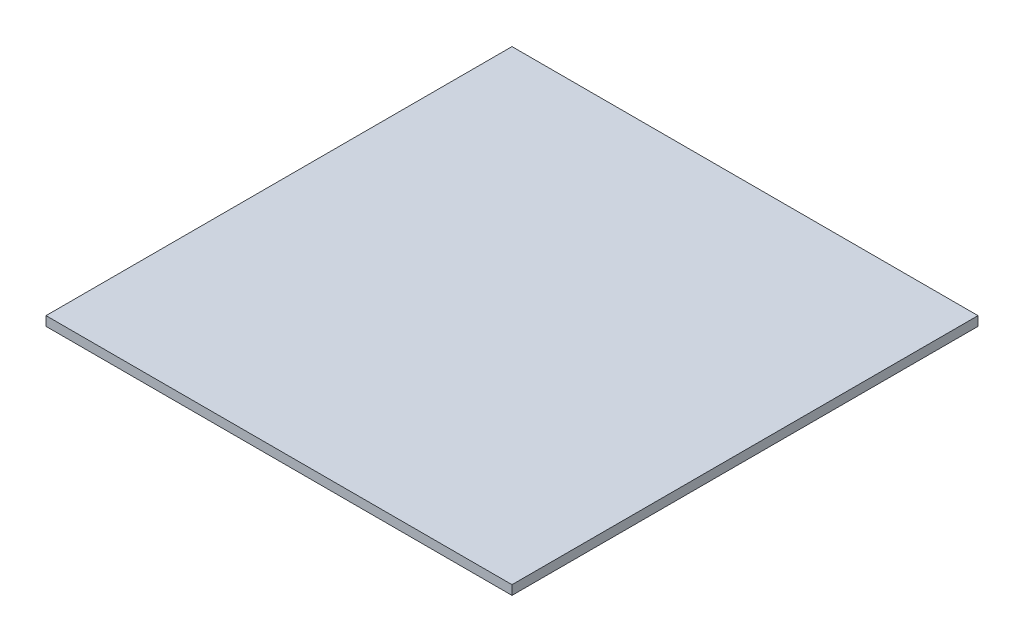
ISO-10303-21;
HEADER;
FILE_DESCRIPTION(('STEP AP214'),'2;1');
FILE_NAME('part.step','',(''),(''),'','','');
FILE_SCHEMA(('AUTOMOTIVE_DESIGN { 1 0 10303 214 1 1 1 1 }'));
ENDSEC;
DATA;
#1=APPLICATION_CONTEXT('core data for automotive mechanical design processes');
#2=APPLICATION_PROTOCOL_DEFINITION('international standard','automotive_design',2000,#1);
#3=PRODUCT_CONTEXT('',#1,'mechanical');
#4=PRODUCT('Part','Part','',(#3));
#5=PRODUCT_RELATED_PRODUCT_CATEGORY('part','',(#4));
#6=PRODUCT_DEFINITION_FORMATION('','',#4);
#7=PRODUCT_DEFINITION_CONTEXT('part definition',#1,'design');
#8=PRODUCT_DEFINITION('design','',#6,#7);
#9=PRODUCT_DEFINITION_SHAPE('','',#8);
#10=(LENGTH_UNIT() NAMED_UNIT(*) SI_UNIT(.MILLI.,.METRE.));
#11=(NAMED_UNIT(*) PLANE_ANGLE_UNIT() SI_UNIT($,.RADIAN.));
#12=(NAMED_UNIT(*) SI_UNIT($,.STERADIAN.) SOLID_ANGLE_UNIT());
#13=UNCERTAINTY_MEASURE_WITH_UNIT(LENGTH_MEASURE(1.E-05),#10,'distance_accuracy_value','');
#14=(GEOMETRIC_REPRESENTATION_CONTEXT(3) GLOBAL_UNCERTAINTY_ASSIGNED_CONTEXT((#13)) GLOBAL_UNIT_ASSIGNED_CONTEXT((#10,
#11,#12)) REPRESENTATION_CONTEXT('',''));
#15=CARTESIAN_POINT('',(0.,0.,0.));
#16=DIRECTION('',(0.,0.,1.));
#17=DIRECTION('',(1.,0.,0.));
#18=AXIS2_PLACEMENT_3D('',#15,#16,#17);
#19=CARTESIAN_POINT('',(500.,20.,500.));
#20=DIRECTION('',(-1.,0.,0.));
#21=DIRECTION('',(0.,0.,1.));
#22=AXIS2_PLACEMENT_3D('',#19,#20,#21);
#23=PLANE('',#22);
#24=DIRECTION('',(0.,0.,-1.));
#25=VECTOR('',#24,1.);
#26=CARTESIAN_POINT('',(500.,0.,500.));
#27=LINE('',#26,#25);
#28=CARTESIAN_POINT('',(500.,0.,500.));
#29=VERTEX_POINT('',#28);
#30=CARTESIAN_POINT('',(500.,0.,-500.));
#31=VERTEX_POINT('',#30);
#32=EDGE_CURVE('E96',#29,#31,#27,.T.);
#33=ORIENTED_EDGE('',*,*,#32,.T.);
#34=DIRECTION('',(0.,-1.,0.));
#35=VECTOR('',#34,1.);
#36=CARTESIAN_POINT('',(500.,20.,-500.));
#37=LINE('',#36,#35);
#38=CARTESIAN_POINT('',(500.,20.,-500.));
#39=VERTEX_POINT('',#38);
#40=EDGE_CURVE('E11',#39,#31,#37,.T.);
#41=ORIENTED_EDGE('',*,*,#40,.F.);
#42=DIRECTION('',(0.,0.,-1.));
#43=VECTOR('',#42,1.);
#44=CARTESIAN_POINT('',(500.,20.,500.));
#45=LINE('',#44,#43);
#46=CARTESIAN_POINT('',(500.,20.,500.));
#47=VERTEX_POINT('',#46);
#48=EDGE_CURVE('E84',#47,#39,#45,.T.);
#49=ORIENTED_EDGE('',*,*,#48,.F.);
#50=DIRECTION('',(0.,-1.,0.));
#51=VECTOR('',#50,1.);
#52=CARTESIAN_POINT('',(500.,20.,500.));
#53=LINE('',#52,#51);
#54=EDGE_CURVE('E92',#47,#29,#53,.T.);
#55=ORIENTED_EDGE('',*,*,#54,.T.);
#56=EDGE_LOOP('',(#33,#41,#49,#55));
#57=FACE_BOUND('',#56,.T.);
#58=ADVANCED_FACE('F33',(#57),#23,.F.);
#59=CARTESIAN_POINT('',(-500.,20.,-500.));
#60=DIRECTION('',(0.,0.,1.));
#61=DIRECTION('',(1.,0.,0.));
#62=AXIS2_PLACEMENT_3D('',#59,#60,#61);
#63=PLANE('',#62);
#64=DIRECTION('',(-1.,0.,0.));
#65=VECTOR('',#64,1.);
#66=CARTESIAN_POINT('',(-500.,0.,-500.));
#67=LINE('',#66,#65);
#68=CARTESIAN_POINT('',(-500.,0.,-500.));
#69=VERTEX_POINT('',#68);
#70=EDGE_CURVE('E88',#31,#69,#67,.T.);
#71=ORIENTED_EDGE('',*,*,#70,.T.);
#72=DIRECTION('',(0.,-1.,0.));
#73=VECTOR('',#72,1.);
#74=CARTESIAN_POINT('',(-500.,20.,-500.));
#75=LINE('',#74,#73);
#76=CARTESIAN_POINT('',(-500.,20.,-500.));
#77=VERTEX_POINT('',#76);
#78=EDGE_CURVE('E41',#77,#69,#75,.T.);
#79=ORIENTED_EDGE('',*,*,#78,.F.);
#80=DIRECTION('',(-1.,0.,0.));
#81=VECTOR('',#80,1.);
#82=CARTESIAN_POINT('',(-500.,20.,-500.));
#83=LINE('',#82,#81);
#84=EDGE_CURVE('E79',#39,#77,#83,.T.);
#85=ORIENTED_EDGE('',*,*,#84,.F.);
#86=ORIENTED_EDGE('',*,*,#40,.T.);
#87=EDGE_LOOP('',(#71,#79,#85,#86));
#88=FACE_BOUND('',#87,.T.);
#89=ADVANCED_FACE('F87',(#88),#63,.F.);
#90=CARTESIAN_POINT('',(-500.,20.,500.));
#91=DIRECTION('',(1.,0.,0.));
#92=DIRECTION('',(0.,0.,-1.));
#93=AXIS2_PLACEMENT_3D('',#90,#91,#92);
#94=PLANE('',#93);
#95=DIRECTION('',(0.,0.,1.));
#96=VECTOR('',#95,1.);
#97=CARTESIAN_POINT('',(-500.,0.,500.));
#98=LINE('',#97,#96);
#99=CARTESIAN_POINT('',(-500.,0.,500.));
#100=VERTEX_POINT('',#99);
#101=EDGE_CURVE('E66',#69,#100,#98,.T.);
#102=ORIENTED_EDGE('',*,*,#101,.T.);
#103=DIRECTION('',(0.,-1.,0.));
#104=VECTOR('',#103,1.);
#105=CARTESIAN_POINT('',(-500.,20.,500.));
#106=LINE('',#105,#104);
#107=CARTESIAN_POINT('',(-500.,20.,500.));
#108=VERTEX_POINT('',#107);
#109=EDGE_CURVE('E89',#108,#100,#106,.T.);
#110=ORIENTED_EDGE('',*,*,#109,.F.);
#111=DIRECTION('',(0.,0.,1.));
#112=VECTOR('',#111,1.);
#113=CARTESIAN_POINT('',(-500.,20.,500.));
#114=LINE('',#113,#112);
#115=EDGE_CURVE('E82',#77,#108,#114,.T.);
#116=ORIENTED_EDGE('',*,*,#115,.F.);
#117=ORIENTED_EDGE('',*,*,#78,.T.);
#118=EDGE_LOOP('',(#102,#110,#116,#117));
#119=FACE_BOUND('',#118,.T.);
#120=ADVANCED_FACE('F90',(#119),#94,.F.);
#121=CARTESIAN_POINT('',(-500.,20.,500.));
#122=DIRECTION('',(0.,0.,-1.));
#123=DIRECTION('',(-1.,0.,0.));
#124=AXIS2_PLACEMENT_3D('',#121,#122,#123);
#125=PLANE('',#124);
#126=DIRECTION('',(1.,0.,0.));
#127=VECTOR('',#126,1.);
#128=CARTESIAN_POINT('',(-500.,0.,500.));
#129=LINE('',#128,#127);
#130=EDGE_CURVE('E72',#100,#29,#129,.T.);
#131=ORIENTED_EDGE('',*,*,#130,.T.);
#132=ORIENTED_EDGE('',*,*,#54,.F.);
#133=DIRECTION('',(1.,0.,0.));
#134=VECTOR('',#133,1.);
#135=CARTESIAN_POINT('',(-500.,20.,500.));
#136=LINE('',#135,#134);
#137=EDGE_CURVE('E49',#108,#47,#136,.T.);
#138=ORIENTED_EDGE('',*,*,#137,.F.);
#139=ORIENTED_EDGE('',*,*,#109,.T.);
#140=EDGE_LOOP('',(#131,#132,#138,#139));
#141=FACE_BOUND('',#140,.T.);
#142=ADVANCED_FACE('F103',(#141),#125,.F.);
#143=CARTESIAN_POINT('',(500.,20.,-500.));
#144=DIRECTION('',(0.,-1.,0.));
#145=DIRECTION('',(0.,0.,-1.));
#146=AXIS2_PLACEMENT_3D('',#143,#144,#145);
#147=PLANE('',#146);
#148=ORIENTED_EDGE('',*,*,#48,.T.);
#149=ORIENTED_EDGE('',*,*,#84,.T.);
#150=ORIENTED_EDGE('',*,*,#115,.T.);
#151=ORIENTED_EDGE('',*,*,#137,.T.);
#152=EDGE_LOOP('',(#148,#149,#150,#151));
#153=FACE_BOUND('',#152,.T.);
#154=ADVANCED_FACE('F80',(#153),#147,.F.);
#155=CARTESIAN_POINT('',(500.,0.,-500.));
#156=DIRECTION('',(0.,-1.,0.));
#157=DIRECTION('',(0.,0.,-1.));
#158=AXIS2_PLACEMENT_3D('',#155,#156,#157);
#159=PLANE('',#158);
#160=ORIENTED_EDGE('',*,*,#32,.F.);
#161=ORIENTED_EDGE('',*,*,#130,.F.);
#162=ORIENTED_EDGE('',*,*,#101,.F.);
#163=ORIENTED_EDGE('',*,*,#70,.F.);
#164=EDGE_LOOP('',(#160,#161,#162,#163));
#165=FACE_BOUND('',#164,.T.);
#166=ADVANCED_FACE('F106',(#165),#159,.T.);
#167=CLOSED_SHELL('',(#58,#89,#120,#142,#154,#166));
#168=MANIFOLD_SOLID_BREP('B2',#167);
#169=ADVANCED_BREP_SHAPE_REPRESENTATION('',(#18,#168),#14);
#170=SHAPE_DEFINITION_REPRESENTATION(#9,#169);
ENDSEC;
END-ISO-10303-21;
